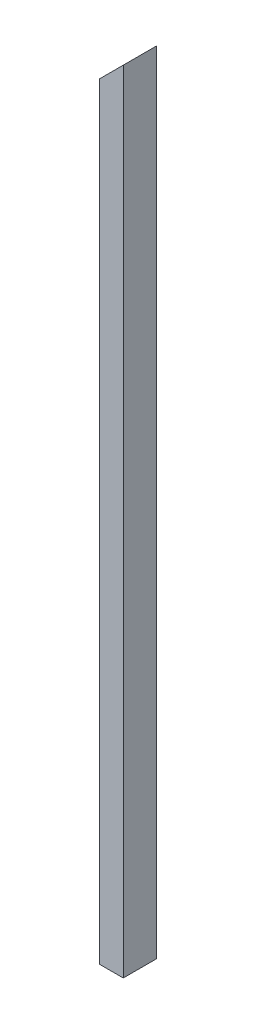
ISO-10303-21;
HEADER;
FILE_DESCRIPTION(('STEP AP214'),'2;1');
FILE_NAME('part.step','',(''),(''),'','','');
FILE_SCHEMA(('AUTOMOTIVE_DESIGN { 1 0 10303 214 1 1 1 1 }'));
ENDSEC;
DATA;
#1=APPLICATION_CONTEXT('core data for automotive mechanical design processes');
#2=APPLICATION_PROTOCOL_DEFINITION('international standard','automotive_design',2000,#1);
#3=PRODUCT_CONTEXT('',#1,'mechanical');
#4=PRODUCT('Part','Part','',(#3));
#5=PRODUCT_RELATED_PRODUCT_CATEGORY('part','',(#4));
#6=PRODUCT_DEFINITION_FORMATION('','',#4);
#7=PRODUCT_DEFINITION_CONTEXT('part definition',#1,'design');
#8=PRODUCT_DEFINITION('design','',#6,#7);
#9=PRODUCT_DEFINITION_SHAPE('','',#8);
#10=(LENGTH_UNIT() NAMED_UNIT(*) SI_UNIT(.MILLI.,.METRE.));
#11=(NAMED_UNIT(*) PLANE_ANGLE_UNIT() SI_UNIT($,.RADIAN.));
#12=(NAMED_UNIT(*) SI_UNIT($,.STERADIAN.) SOLID_ANGLE_UNIT());
#13=UNCERTAINTY_MEASURE_WITH_UNIT(LENGTH_MEASURE(1.E-05),#10,'distance_accuracy_value','');
#14=(GEOMETRIC_REPRESENTATION_CONTEXT(3) GLOBAL_UNCERTAINTY_ASSIGNED_CONTEXT((#13)) GLOBAL_UNIT_ASSIGNED_CONTEXT((#10,
#11,#12)) REPRESENTATION_CONTEXT('',''));
#15=CARTESIAN_POINT('',(0.,0.,0.));
#16=DIRECTION('',(0.,0.,1.));
#17=DIRECTION('',(1.,0.,0.));
#18=AXIS2_PLACEMENT_3D('',#15,#16,#17);
#19=CARTESIAN_POINT('',(63.5,0.,88.9));
#20=DIRECTION('',(0.,1.,0.));
#21=DIRECTION('',(-1.,0.,0.));
#22=AXIS2_PLACEMENT_3D('',#19,#20,#21);
#23=PLANE('',#22);
#24=DIRECTION('',(1.,0.,0.));
#25=VECTOR('',#24,1.);
#26=CARTESIAN_POINT('',(63.5,0.,0.));
#27=LINE('',#26,#25);
#28=CARTESIAN_POINT('',(0.,0.,0.));
#29=VERTEX_POINT('',#28);
#30=CARTESIAN_POINT('',(63.5,0.,0.));
#31=VERTEX_POINT('',#30);
#32=EDGE_CURVE('E97',#29,#31,#27,.T.);
#33=ORIENTED_EDGE('',*,*,#32,.T.);
#34=DIRECTION('',(0.,0.,-1.));
#35=VECTOR('',#34,1.);
#36=CARTESIAN_POINT('',(63.5,0.,88.9));
#37=LINE('',#36,#35);
#38=CARTESIAN_POINT('',(63.5,0.,88.9));
#39=VERTEX_POINT('',#38);
#40=EDGE_CURVE('E11',#39,#31,#37,.T.);
#41=ORIENTED_EDGE('',*,*,#40,.F.);
#42=DIRECTION('',(1.,0.,0.));
#43=VECTOR('',#42,1.);
#44=CARTESIAN_POINT('',(63.5,0.,88.9));
#45=LINE('',#44,#43);
#46=CARTESIAN_POINT('',(0.,0.,88.9));
#47=VERTEX_POINT('',#46);
#48=EDGE_CURVE('E85',#47,#39,#45,.T.);
#49=ORIENTED_EDGE('',*,*,#48,.F.);
#50=DIRECTION('',(0.,0.,-1.));
#51=VECTOR('',#50,1.);
#52=CARTESIAN_POINT('',(0.,0.,88.9));
#53=LINE('',#52,#51);
#54=EDGE_CURVE('E93',#47,#29,#53,.T.);
#55=ORIENTED_EDGE('',*,*,#54,.T.);
#56=EDGE_LOOP('',(#33,#41,#49,#55));
#57=FACE_BOUND('',#56,.T.);
#58=ADVANCED_FACE('F34',(#57),#23,.F.);
#59=CARTESIAN_POINT('',(63.5,0.,88.9));
#60=DIRECTION('',(-1.,0.,0.));
#61=DIRECTION('',(0.,-1.,0.));
#62=AXIS2_PLACEMENT_3D('',#59,#60,#61);
#63=PLANE('',#62);
#64=DIRECTION('',(0.,1.,0.));
#65=VECTOR('',#64,1.);
#66=CARTESIAN_POINT('',(63.5,0.,0.));
#67=LINE('',#66,#65);
#68=CARTESIAN_POINT('',(63.4999999999999,2120.9,0.));
#69=VERTEX_POINT('',#68);
#70=EDGE_CURVE('E89',#31,#69,#67,.T.);
#71=ORIENTED_EDGE('',*,*,#70,.T.);
#72=DIRECTION('',(0.,0.,-1.));
#73=VECTOR('',#72,1.);
#74=CARTESIAN_POINT('',(63.4999999999999,2120.9,88.9));
#75=LINE('',#74,#73);
#76=CARTESIAN_POINT('',(63.4999999999999,2120.9,88.9));
#77=VERTEX_POINT('',#76);
#78=EDGE_CURVE('E42',#77,#69,#75,.T.);
#79=ORIENTED_EDGE('',*,*,#78,.F.);
#80=DIRECTION('',(0.,1.,0.));
#81=VECTOR('',#80,1.);
#82=CARTESIAN_POINT('',(63.5,0.,88.9));
#83=LINE('',#82,#81);
#84=EDGE_CURVE('E80',#39,#77,#83,.T.);
#85=ORIENTED_EDGE('',*,*,#84,.F.);
#86=ORIENTED_EDGE('',*,*,#40,.T.);
#87=EDGE_LOOP('',(#71,#79,#85,#86));
#88=FACE_BOUND('',#87,.T.);
#89=ADVANCED_FACE('F88',(#88),#63,.F.);
#90=CARTESIAN_POINT('',(0.,2057.4,88.9));
#91=DIRECTION('',(0.707106781186547,-0.707106781186547,0.));
#92=DIRECTION('',(0.707106781186548,0.707106781186548,0.));
#93=AXIS2_PLACEMENT_3D('',#90,#91,#92);
#94=PLANE('',#93);
#95=DIRECTION('',(-0.707106781186548,-0.707106781186548,0.));
#96=VECTOR('',#95,1.);
#97=CARTESIAN_POINT('',(0.,2057.4,0.));
#98=LINE('',#97,#96);
#99=CARTESIAN_POINT('',(0.,2057.4,0.));
#100=VERTEX_POINT('',#99);
#101=EDGE_CURVE('E67',#69,#100,#98,.T.);
#102=ORIENTED_EDGE('',*,*,#101,.T.);
#103=DIRECTION('',(0.,0.,-1.));
#104=VECTOR('',#103,1.);
#105=CARTESIAN_POINT('',(0.,2057.4,88.9));
#106=LINE('',#105,#104);
#107=CARTESIAN_POINT('',(0.,2057.4,88.9));
#108=VERTEX_POINT('',#107);
#109=EDGE_CURVE('E90',#108,#100,#106,.T.);
#110=ORIENTED_EDGE('',*,*,#109,.F.);
#111=DIRECTION('',(-0.707106781186548,-0.707106781186548,0.));
#112=VECTOR('',#111,1.);
#113=CARTESIAN_POINT('',(0.,2057.4,88.9));
#114=LINE('',#113,#112);
#115=EDGE_CURVE('E83',#77,#108,#114,.T.);
#116=ORIENTED_EDGE('',*,*,#115,.F.);
#117=ORIENTED_EDGE('',*,*,#78,.T.);
#118=EDGE_LOOP('',(#102,#110,#116,#117));
#119=FACE_BOUND('',#118,.T.);
#120=ADVANCED_FACE('F91',(#119),#94,.F.);
#121=CARTESIAN_POINT('',(0.,0.,88.9));
#122=DIRECTION('',(1.,0.,0.));
#123=DIRECTION('',(0.,0.,-1.));
#124=AXIS2_PLACEMENT_3D('',#121,#122,#123);
#125=PLANE('',#124);
#126=DIRECTION('',(0.,-1.,0.));
#127=VECTOR('',#126,1.);
#128=CARTESIAN_POINT('',(0.,0.,0.));
#129=LINE('',#128,#127);
#130=EDGE_CURVE('E73',#100,#29,#129,.T.);
#131=ORIENTED_EDGE('',*,*,#130,.T.);
#132=ORIENTED_EDGE('',*,*,#54,.F.);
#133=DIRECTION('',(0.,-1.,0.));
#134=VECTOR('',#133,1.);
#135=CARTESIAN_POINT('',(0.,0.,88.9));
#136=LINE('',#135,#134);
#137=EDGE_CURVE('E50',#108,#47,#136,.T.);
#138=ORIENTED_EDGE('',*,*,#137,.F.);
#139=ORIENTED_EDGE('',*,*,#109,.T.);
#140=EDGE_LOOP('',(#131,#132,#138,#139));
#141=FACE_BOUND('',#140,.T.);
#142=ADVANCED_FACE('F104',(#141),#125,.F.);
#143=CARTESIAN_POINT('',(0.,0.,88.9));
#144=DIRECTION('',(0.,0.,-1.));
#145=DIRECTION('',(-1.,0.,0.));
#146=AXIS2_PLACEMENT_3D('',#143,#144,#145);
#147=PLANE('',#146);
#148=ORIENTED_EDGE('',*,*,#48,.T.);
#149=ORIENTED_EDGE('',*,*,#84,.T.);
#150=ORIENTED_EDGE('',*,*,#115,.T.);
#151=ORIENTED_EDGE('',*,*,#137,.T.);
#152=EDGE_LOOP('',(#148,#149,#150,#151));
#153=FACE_BOUND('',#152,.T.);
#154=ADVANCED_FACE('F81',(#153),#147,.F.);
#155=CARTESIAN_POINT('',(0.,0.,0.));
#156=DIRECTION('',(0.,0.,-1.));
#157=DIRECTION('',(-1.,0.,0.));
#158=AXIS2_PLACEMENT_3D('',#155,#156,#157);
#159=PLANE('',#158);
#160=ORIENTED_EDGE('',*,*,#32,.F.);
#161=ORIENTED_EDGE('',*,*,#130,.F.);
#162=ORIENTED_EDGE('',*,*,#101,.F.);
#163=ORIENTED_EDGE('',*,*,#70,.F.);
#164=EDGE_LOOP('',(#160,#161,#162,#163));
#165=FACE_BOUND('',#164,.T.);
#166=ADVANCED_FACE('F107',(#165),#159,.T.);
#167=CLOSED_SHELL('',(#58,#89,#120,#142,#154,#166));
#168=MANIFOLD_SOLID_BREP('B2',#167);
#169=ADVANCED_BREP_SHAPE_REPRESENTATION('',(#18,#168),#14);
#170=SHAPE_DEFINITION_REPRESENTATION(#9,#169);
ENDSEC;
END-ISO-10303-21;
